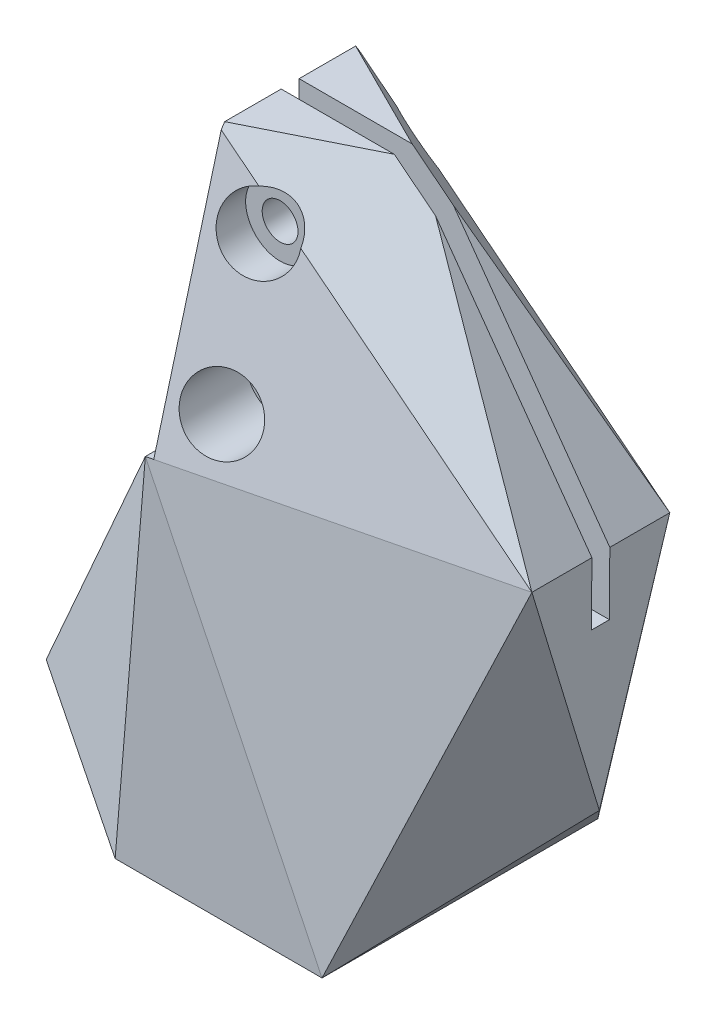
ISO-10303-21;
HEADER;
FILE_DESCRIPTION(('STEP AP214'),'2;1');
FILE_NAME('part.step','',(''),(''),'','','');
FILE_SCHEMA(('AUTOMOTIVE_DESIGN { 1 0 10303 214 1 1 1 1 }'));
ENDSEC;
DATA;
#1=APPLICATION_CONTEXT('core data for automotive mechanical design processes');
#2=APPLICATION_PROTOCOL_DEFINITION('international standard','automotive_design',2000,#1);
#3=PRODUCT_CONTEXT('',#1,'mechanical');
#4=PRODUCT('Part','Part','',(#3));
#5=PRODUCT_RELATED_PRODUCT_CATEGORY('part','',(#4));
#6=PRODUCT_DEFINITION_FORMATION('','',#4);
#7=PRODUCT_DEFINITION_CONTEXT('part definition',#1,'design');
#8=PRODUCT_DEFINITION('design','',#6,#7);
#9=PRODUCT_DEFINITION_SHAPE('','',#8);
#10=(LENGTH_UNIT() NAMED_UNIT(*) SI_UNIT(.MILLI.,.METRE.));
#11=(NAMED_UNIT(*) PLANE_ANGLE_UNIT() SI_UNIT($,.RADIAN.));
#12=(NAMED_UNIT(*) SI_UNIT($,.STERADIAN.) SOLID_ANGLE_UNIT());
#13=UNCERTAINTY_MEASURE_WITH_UNIT(LENGTH_MEASURE(1.E-05),#10,'distance_accuracy_value','');
#14=(GEOMETRIC_REPRESENTATION_CONTEXT(3) GLOBAL_UNCERTAINTY_ASSIGNED_CONTEXT((#13)) GLOBAL_UNIT_ASSIGNED_CONTEXT((#10,
#11,#12)) REPRESENTATION_CONTEXT('',''));
#15=CARTESIAN_POINT('',(0.,0.,0.));
#16=DIRECTION('',(0.,0.,1.));
#17=DIRECTION('',(1.,0.,0.));
#18=AXIS2_PLACEMENT_3D('',#15,#16,#17);
#19=CARTESIAN_POINT('',(-9.58235878698284,-34.6808000577524,25.4));
#20=DIRECTION('',(0.837497848640576,-0.546440622137856,0.));
#21=DIRECTION('',(0.546440622137856,0.837497848640576,0.));
#22=AXIS2_PLACEMENT_3D('',#19,#20,#21);
#23=PLANE('',#22);
#24=DIRECTION('',(-0.546440622137856,-0.837497848640576,0.));
#25=VECTOR('',#24,1.);
#26=CARTESIAN_POINT('',(-9.58235878698284,-34.6808000577524,11.049));
#27=LINE('',#26,#25);
#28=CARTESIAN_POINT('',(-9.58235878698284,-34.6808000577524,11.049));
#29=VERTEX_POINT('',#28);
#30=CARTESIAN_POINT('',(-16.3338265826701,-45.0283831710512,11.049));
#31=VERTEX_POINT('',#30);
#32=EDGE_CURVE('E296',#29,#31,#27,.T.);
#33=ORIENTED_EDGE('',*,*,#32,.F.);
#34=DIRECTION('',(0.,0.,-1.));
#35=VECTOR('',#34,1.);
#36=CARTESIAN_POINT('',(-9.58235878698284,-34.6808000577524,25.4));
#37=LINE('',#36,#35);
#38=CARTESIAN_POINT('',(-9.58235878698284,-34.6808000577524,-12.7));
#39=VERTEX_POINT('',#38);
#40=EDGE_CURVE('E197',#29,#39,#37,.T.);
#41=ORIENTED_EDGE('',*,*,#40,.T.);
#42=DIRECTION('',(0.520762367262036,0.798142276700834,-0.302944653338607));
#43=VECTOR('',#42,1.);
#44=CARTESIAN_POINT('',(-15.5930976477007,-43.8931108938262,-9.20335486021627));
#45=LINE('',#44,#43);
#46=CARTESIAN_POINT('',(-53.2450013940838,-101.6,12.7));
#47=VERTEX_POINT('',#46);
#48=EDGE_CURVE('E227',#47,#39,#45,.T.);
#49=ORIENTED_EDGE('',*,*,#48,.F.);
#50=DIRECTION('',(-0.520762367262036,-0.798142276700834,-0.302944653338607));
#51=VECTOR('',#50,1.);
#52=CARTESIAN_POINT('',(-11.5859384072221,-37.7515703364437,36.9344516200721));
#53=LINE('',#52,#51);
#54=CARTESIAN_POINT('',(-9.58235878698284,-34.6808000577524,38.1));
#55=VERTEX_POINT('',#54);
#56=EDGE_CURVE('E216',#55,#47,#53,.T.);
#57=ORIENTED_EDGE('',*,*,#56,.F.);
#58=CARTESIAN_POINT('',(-9.58235878698284,-34.6808000577524,14.351));
#59=VERTEX_POINT('',#58);
#60=EDGE_CURVE('E187',#55,#59,#37,.T.);
#61=ORIENTED_EDGE('',*,*,#60,.T.);
#62=DIRECTION('',(-0.546440622137856,-0.837497848640576,0.));
#63=VECTOR('',#62,1.);
#64=CARTESIAN_POINT('',(-9.58235878698284,-34.6808000577524,14.351));
#65=LINE('',#64,#63);
#66=CARTESIAN_POINT('',(-16.3338265826701,-45.0283831710512,14.351));
#67=VERTEX_POINT('',#66);
#68=EDGE_CURVE('E270',#59,#67,#65,.T.);
#69=ORIENTED_EDGE('',*,*,#68,.T.);
#70=DIRECTION('',(0.,0.,-1.));
#71=VECTOR('',#70,1.);
#72=CARTESIAN_POINT('',(-16.3338265826701,-45.0283831710512,25.4));
#73=LINE('',#72,#71);
#74=EDGE_CURVE('E298',#67,#31,#73,.T.);
#75=ORIENTED_EDGE('',*,*,#74,.T.);
#76=EDGE_LOOP('',(#33,#41,#49,#57,#61,#69,#75));
#77=FACE_BOUND('',#76,.T.);
#78=ADVANCED_FACE('F63',(#77),#23,.F.);
#79=CARTESIAN_POINT('',(48.9151984851401,-33.4491422234161,25.4));
#80=DIRECTION('',(-0.99997769081638,0.00667966088518276,0.));
#81=DIRECTION('',(-0.00667966088518276,-0.99997769081638,0.));
#82=AXIS2_PLACEMENT_3D('',#79,#80,#81);
#83=PLANE('',#82);
#84=DIRECTION('',(0.00667966088518276,0.99997769081638,0.));
#85=VECTOR('',#84,1.);
#86=CARTESIAN_POINT('',(48.9151984851401,-33.4491422234161,11.049));
#87=LINE('',#86,#85);
#88=CARTESIAN_POINT('',(48.8378513567508,-45.0283831710512,11.049));
#89=VERTEX_POINT('',#88);
#90=CARTESIAN_POINT('',(48.9151984851401,-33.4491422234161,11.049));
#91=VERTEX_POINT('',#90);
#92=EDGE_CURVE('E294',#89,#91,#87,.T.);
#93=ORIENTED_EDGE('',*,*,#92,.F.);
#94=DIRECTION('',(0.,0.,1.));
#95=VECTOR('',#94,1.);
#96=CARTESIAN_POINT('',(48.8378513567508,-45.0283831710512,25.4));
#97=LINE('',#96,#95);
#98=CARTESIAN_POINT('',(48.8378513567508,-45.0283831710512,14.351));
#99=VERTEX_POINT('',#98);
#100=EDGE_CURVE('E260',#89,#99,#97,.T.);
#101=ORIENTED_EDGE('',*,*,#100,.T.);
#102=DIRECTION('',(0.00667966088518276,0.99997769081638,0.));
#103=VECTOR('',#102,1.);
#104=CARTESIAN_POINT('',(48.9151984851401,-33.4491422234161,14.351));
#105=LINE('',#104,#103);
#106=CARTESIAN_POINT('',(48.9151984851401,-33.4491422234161,14.351));
#107=VERTEX_POINT('',#106);
#108=EDGE_CURVE('E279',#99,#107,#105,.T.);
#109=ORIENTED_EDGE('',*,*,#108,.T.);
#110=DIRECTION('',(0.,0.,-1.));
#111=VECTOR('',#110,1.);
#112=CARTESIAN_POINT('',(48.9151984851401,-33.4491422234161,25.4));
#113=LINE('',#112,#111);
#114=CARTESIAN_POINT('',(48.9151984851401,-33.4491422234161,25.4));
#115=VERTEX_POINT('',#114);
#116=EDGE_CURVE('E367',#115,#107,#113,.T.);
#117=ORIENTED_EDGE('',*,*,#116,.F.);
#118=DIRECTION('',(0.00638433306019924,0.955765680425864,0.294059865353064));
#119=VECTOR('',#118,1.);
#120=CARTESIAN_POINT('',(48.9151984851401,-33.4491422234161,25.4));
#121=LINE('',#120,#119);
#122=CARTESIAN_POINT('',(48.639468814356,-74.7272137032992,12.7));
#123=VERTEX_POINT('',#122);
#124=EDGE_CURVE('E233',#123,#115,#121,.T.);
#125=ORIENTED_EDGE('',*,*,#124,.F.);
#126=DIRECTION('',(-0.00638433306019924,-0.955765680425864,0.294059865353064));
#127=VECTOR('',#126,1.);
#128=CARTESIAN_POINT('',(48.8675131316908,-40.5878713367119,2.19636859205113));
#129=LINE('',#128,#127);
#130=CARTESIAN_POINT('',(48.9151984851401,-33.4491422234161,0.));
#131=VERTEX_POINT('',#130);
#132=EDGE_CURVE('E342',#131,#123,#129,.T.);
#133=ORIENTED_EDGE('',*,*,#132,.F.);
#134=EDGE_CURVE('E366',#91,#131,#113,.T.);
#135=ORIENTED_EDGE('',*,*,#134,.F.);
#136=EDGE_LOOP('',(#93,#101,#109,#117,#125,#133,#135));
#137=FACE_BOUND('',#136,.T.);
#138=ADVANCED_FACE('F397',(#137),#83,.F.);
#139=CARTESIAN_POINT('',(-9.58235878698284,12.7,25.4));
#140=DIRECTION('',(0.,-1.,0.));
#141=DIRECTION('',(0.,0.,-1.));
#142=AXIS2_PLACEMENT_3D('',#139,#140,#141);
#143=PLANE('',#142);
#144=DIRECTION('',(0.894427190999916,0.,0.447213595499958));
#145=VECTOR('',#144,1.);
#146=CARTESIAN_POINT('',(0.57764121301716,12.7,5.07999999999999));
#147=LINE('',#146,#145);
#148=CARTESIAN_POINT('',(-8.31235878698285,12.7,0.63499999999998));
#149=VERTEX_POINT('',#148);
#150=CARTESIAN_POINT('',(12.5156412130172,12.7,11.049));
#151=VERTEX_POINT('',#150);
#152=EDGE_CURVE('E351',#149,#151,#147,.T.);
#153=ORIENTED_EDGE('',*,*,#152,.F.);
#154=DIRECTION('',(0.,0.,1.));
#155=VECTOR('',#154,1.);
#156=CARTESIAN_POINT('',(-8.31235878698284,12.7,-12.7));
#157=LINE('',#156,#155);
#158=CARTESIAN_POINT('',(-8.31235878698284,12.7,11.049));
#159=VERTEX_POINT('',#158);
#160=EDGE_CURVE('E826',#149,#159,#157,.T.);
#161=ORIENTED_EDGE('',*,*,#160,.T.);
#162=DIRECTION('',(-1.,0.,0.));
#163=VECTOR('',#162,1.);
#164=CARTESIAN_POINT('',(-9.58235878698284,12.7,11.049));
#165=LINE('',#164,#163);
#166=EDGE_CURVE('E291',#151,#159,#165,.T.);
#167=ORIENTED_EDGE('',*,*,#166,.F.);
#168=EDGE_LOOP('',(#153,#161,#167));
#169=FACE_BOUND('',#168,.T.);
#170=ADVANCED_FACE('F441',(#169),#143,.F.);
#171=CARTESIAN_POINT('',(15.8176412130172,12.7,25.4));
#172=DIRECTION('',(-0.812616939968756,-0.582798171647626,0.));
#173=DIRECTION('',(0.582798171647626,-0.812616939968756,0.));
#174=AXIS2_PLACEMENT_3D('',#171,#172,#173);
#175=PLANE('',#174);
#176=DIRECTION('',(-0.582798171647626,0.812616939968756,0.));
#177=VECTOR('',#176,1.);
#178=CARTESIAN_POINT('',(15.8176412130172,12.7,11.049));
#179=LINE('',#178,#177);
#180=CARTESIAN_POINT('',(20.1203236583931,6.70061151095598,11.049));
#181=VERTEX_POINT('',#180);
#182=EDGE_CURVE('E86',#91,#181,#179,.T.);
#183=ORIENTED_EDGE('',*,*,#182,.F.);
#184=ORIENTED_EDGE('',*,*,#134,.T.);
#185=DIRECTION('',(0.568750223836933,-0.793029369317163,-0.218237490559851));
#186=VECTOR('',#185,1.);
#187=CARTESIAN_POINT('',(14.241283918627,14.8979729916505,13.3048705490304));
#188=LINE('',#187,#186);
#189=EDGE_CURVE('E348',#181,#131,#188,.T.);
#190=ORIENTED_EDGE('',*,*,#189,.F.);
#191=EDGE_LOOP('',(#183,#184,#190));
#192=FACE_BOUND('',#191,.T.);
#193=ADVANCED_FACE('F456',(#192),#175,.F.);
#194=CARTESIAN_POINT('',(8.67534920626133,10.9966667330913,8.04930158747733));
#195=DIRECTION('',(0.389050588844536,0.493151291794514,-0.778101177689072));
#196=DIRECTION('',(0.,-0.844645389688986,-0.535326223603085));
#197=AXIS2_PLACEMENT_3D('',#194,#195,#196);
#198=PLANE('',#197);
#199=DIRECTION('',(0.,-0.844645389688986,-0.535326223603085));
#200=VECTOR('',#199,1.);
#201=CARTESIAN_POINT('',(-8.31235878698285,14.8372547784634,1.98956671332066));
#202=LINE('',#201,#200);
#203=CARTESIAN_POINT('',(-8.31235878698284,11.6980878970537,0.));
#204=VERTEX_POINT('',#203);
#205=EDGE_CURVE('E836',#149,#204,#202,.T.);
#206=ORIENTED_EDGE('',*,*,#205,.F.);
#207=ORIENTED_EDGE('',*,*,#152,.T.);
#208=DIRECTION('',(0.785099031532993,-0.619370253310535,0.));
#209=VECTOR('',#208,1.);
#210=CARTESIAN_POINT('',(10.9768348806961,13.9139753452307,11.049));
#211=LINE('',#210,#209);
#212=EDGE_CURVE('E288',#151,#181,#211,.T.);
#213=ORIENTED_EDGE('',*,*,#212,.T.);
#214=ORIENTED_EDGE('',*,*,#189,.T.);
#215=DIRECTION('',(0.785099031532993,-0.619370253310535,0.));
#216=VECTOR('',#215,1.);
#217=CARTESIAN_POINT('',(2.49961093355784,3.16844748784153,0.));
#218=LINE('',#217,#216);
#219=CARTESIAN_POINT('',(6.34862935351327,0.131929267828256,0.));
#220=VERTEX_POINT('',#219);
#221=EDGE_CURVE('E345',#220,#131,#218,.T.);
#222=ORIENTED_EDGE('',*,*,#221,.F.);
#223=CARTESIAN_POINT('',(0.,0.,-3.25792988094928));
#224=DIRECTION('',(0.389050588844536,0.493151291794514,-0.778101177689072));
#225=DIRECTION('',(-0.481932723526507,-0.610886481038372,-0.628138963350371));
#226=AXIS2_PLACEMENT_3D('',#223,#224,#225);
#227=ELLIPSE('',#226,8.16089241614983,6.35);
#228=CARTESIAN_POINT('',(-1.34940748639759,6.20496570785481,0.));
#229=VERTEX_POINT('',#228);
#230=EDGE_CURVE('E221',#220,#229,#227,.F.);
#231=ORIENTED_EDGE('',*,*,#230,.T.);
#232=EDGE_CURVE('E346',#204,#229,#218,.T.);
#233=ORIENTED_EDGE('',*,*,#232,.F.);
#234=EDGE_LOOP('',(#206,#207,#213,#214,#222,#231,#233));
#235=FACE_BOUND('',#234,.T.);
#236=ADVANCED_FACE('F469',(#235),#198,.T.);
#237=CARTESIAN_POINT('',(0.,-25.4,-12.7));
#238=DIRECTION('',(0.,0.,1.));
#239=DIRECTION('',(1.,0.,0.));
#240=AXIS2_PLACEMENT_3D('',#237,#238,#239);
#241=CYLINDRICAL_SURFACE('',#240,3.302);
#242=CARTESIAN_POINT('',(0.,-25.4,2.54));
#243=DIRECTION('',(0.,0.,1.));
#244=DIRECTION('',(1.,0.,0.));
#245=AXIS2_PLACEMENT_3D('',#242,#243,#244);
#246=CIRCLE('',#245,3.302);
#247=CARTESIAN_POINT('',(3.302,-25.4,2.54));
#248=VERTEX_POINT('',#247);
#249=EDGE_CURVE('E313',#248,#248,#246,.T.);
#250=ORIENTED_EDGE('',*,*,#249,.F.);
#251=EDGE_LOOP('',(#250));
#252=FACE_BOUND('',#251,.T.);
#253=CARTESIAN_POINT('',(0.,-25.4,11.049));
#254=DIRECTION('',(0.,0.,1.));
#255=DIRECTION('',(1.,0.,0.));
#256=AXIS2_PLACEMENT_3D('',#253,#254,#255);
#257=CIRCLE('',#256,3.302);
#258=CARTESIAN_POINT('',(3.302,-25.4,11.049));
#259=VERTEX_POINT('',#258);
#260=EDGE_CURVE('E269',#259,#259,#257,.F.);
#261=ORIENTED_EDGE('',*,*,#260,.F.);
#262=EDGE_LOOP('',(#261));
#263=FACE_BOUND('',#262,.T.);
#264=ADVANCED_FACE('F472',(#252,#263),#241,.F.);
#265=CARTESIAN_POINT('',(0.,0.,-12.7));
#266=DIRECTION('',(0.,0.,1.));
#267=DIRECTION('',(1.,0.,0.));
#268=AXIS2_PLACEMENT_3D('',#265,#266,#267);
#269=CYLINDRICAL_SURFACE('',#268,3.302);
#270=CARTESIAN_POINT('',(0.,0.,2.54));
#271=DIRECTION('',(0.,0.,1.));
#272=DIRECTION('',(1.,0.,0.));
#273=AXIS2_PLACEMENT_3D('',#270,#271,#272);
#274=CIRCLE('',#273,3.302);
#275=CARTESIAN_POINT('',(3.302,0.,2.54));
#276=VERTEX_POINT('',#275);
#277=EDGE_CURVE('E314',#276,#276,#274,.T.);
#278=ORIENTED_EDGE('',*,*,#277,.F.);
#279=EDGE_LOOP('',(#278));
#280=FACE_BOUND('',#279,.T.);
#281=CARTESIAN_POINT('',(0.,0.,11.049));
#282=DIRECTION('',(0.,0.,1.));
#283=DIRECTION('',(1.,0.,0.));
#284=AXIS2_PLACEMENT_3D('',#281,#282,#283);
#285=CIRCLE('',#284,3.302);
#286=CARTESIAN_POINT('',(3.302,0.,11.049));
#287=VERTEX_POINT('',#286);
#288=EDGE_CURVE('E266',#287,#287,#285,.F.);
#289=ORIENTED_EDGE('',*,*,#288,.F.);
#290=EDGE_LOOP('',(#289));
#291=FACE_BOUND('',#290,.T.);
#292=ADVANCED_FACE('F447',(#280,#291),#269,.F.);
#293=CARTESIAN_POINT('',(22.9549986059162,-101.6,25.4));
#294=DIRECTION('',(0.,1.,0.));
#295=DIRECTION('',(-1.,0.,0.));
#296=AXIS2_PLACEMENT_3D('',#293,#294,#295);
#297=PLANE('',#296);
#298=DIRECTION('',(0.832050294337844,0.,0.554700196225229));
#299=VECTOR('',#298,1.);
#300=CARTESIAN_POINT('',(5.37038322130083,-101.6,51.7769230769231));
#301=LINE('',#300,#299);
#302=CARTESIAN_POINT('',(-15.1450013940838,-101.6,38.1));
#303=VERTEX_POINT('',#302);
#304=EDGE_CURVE('E218',#47,#303,#301,.T.);
#305=ORIENTED_EDGE('',*,*,#304,.F.);
#306=DIRECTION('',(-0.832050294337844,0.,0.554700196225229));
#307=VECTOR('',#306,1.);
#308=CARTESIAN_POINT('',(-6.35269370177609,-101.6,-18.5615384615385));
#309=LINE('',#308,#307);
#310=CARTESIAN_POINT('',(-15.1450013940838,-101.6,-12.7));
#311=VERTEX_POINT('',#310);
#312=EDGE_CURVE('E236',#311,#47,#309,.T.);
#313=ORIENTED_EDGE('',*,*,#312,.F.);
#314=DIRECTION('',(1.,0.,0.));
#315=VECTOR('',#314,1.);
#316=CARTESIAN_POINT('',(-53.2450013940838,-101.6,-12.7));
#317=LINE('',#316,#315);
#318=CARTESIAN_POINT('',(22.9549986059162,-101.6,-12.7));
#319=VERTEX_POINT('',#318);
#320=EDGE_CURVE('E340',#311,#319,#317,.T.);
#321=ORIENTED_EDGE('',*,*,#320,.T.);
#322=DIRECTION('',(0.,0.,-1.));
#323=VECTOR('',#322,1.);
#324=CARTESIAN_POINT('',(22.9549986059162,-101.6,25.4));
#325=LINE('',#324,#323);
#326=CARTESIAN_POINT('',(22.9549986059162,-101.6,38.1));
#327=VERTEX_POINT('',#326);
#328=EDGE_CURVE('E370',#327,#319,#325,.T.);
#329=ORIENTED_EDGE('',*,*,#328,.F.);
#330=DIRECTION('',(1.,0.,0.));
#331=VECTOR('',#330,1.);
#332=CARTESIAN_POINT('',(-53.2450013940838,-101.6,38.1));
#333=LINE('',#332,#331);
#334=EDGE_CURVE('E230',#303,#327,#333,.T.);
#335=ORIENTED_EDGE('',*,*,#334,.F.);
#336=EDGE_LOOP('',(#305,#313,#321,#329,#335));
#337=FACE_BOUND('',#336,.T.);
#338=ADVANCED_FACE('F444',(#337),#297,.F.);
#339=CARTESIAN_POINT('',(0.,0.,38.1));
#340=DIRECTION('',(0.,0.,1.));
#341=DIRECTION('',(1.,0.,0.));
#342=AXIS2_PLACEMENT_3D('',#339,#340,#341);
#343=PLANE('',#342);
#344=DIRECTION('',(-0.437270871141113,0.899329853419474,0.));
#345=VECTOR('',#344,1.);
#346=CARTESIAN_POINT('',(-21.3884066473898,-10.3994403960503,38.1));
#347=LINE('',#346,#345);
#348=EDGE_CURVE('E206',#327,#55,#347,.T.);
#349=ORIENTED_EDGE('',*,*,#348,.T.);
#350=DIRECTION('',(-0.0828390576623097,-0.996562938567164,0.));
#351=VECTOR('',#350,1.);
#352=CARTESIAN_POINT('',(-6.65355129874775,0.55307487200815,38.1));
#353=LINE('',#352,#351);
#354=EDGE_CURVE('E214',#55,#303,#353,.T.);
#355=ORIENTED_EDGE('',*,*,#354,.T.);
#356=ORIENTED_EDGE('',*,*,#334,.T.);
#357=EDGE_LOOP('',(#349,#355,#356));
#358=FACE_BOUND('',#357,.T.);
#359=ADVANCED_FACE('F229',(#358),#343,.T.);
#360=CARTESIAN_POINT('',(0.,0.,-12.7));
#361=DIRECTION('',(0.,0.,-1.));
#362=DIRECTION('',(1.,0.,0.));
#363=AXIS2_PLACEMENT_3D('',#360,#361,#362);
#364=PLANE('',#363);
#365=ORIENTED_EDGE('',*,*,#320,.F.);
#366=DIRECTION('',(0.0828390576623097,0.996562938567164,0.));
#367=VECTOR('',#366,1.);
#368=CARTESIAN_POINT('',(-6.65355129874776,0.553074872008151,-12.7));
#369=LINE('',#368,#367);
#370=EDGE_CURVE('E328',#311,#39,#369,.T.);
#371=ORIENTED_EDGE('',*,*,#370,.T.);
#372=DIRECTION('',(0.437270871141113,-0.899329853419474,0.));
#373=VECTOR('',#372,1.);
#374=CARTESIAN_POINT('',(-21.3884066473898,-10.3994403960503,-12.7));
#375=LINE('',#374,#373);
#376=EDGE_CURVE('E232',#39,#319,#375,.T.);
#377=ORIENTED_EDGE('',*,*,#376,.T.);
#378=EDGE_LOOP('',(#365,#371,#377));
#379=FACE_BOUND('',#378,.T.);
#380=ADVANCED_FACE('F451',(#379),#364,.T.);
#381=CARTESIAN_POINT('',(48.6394688143563,-74.7272137032988,25.4));
#382=DIRECTION('',(-0.72290966327967,0.690942558203555,0.));
#383=DIRECTION('',(-0.690942558203555,-0.72290966327967,0.));
#384=AXIS2_PLACEMENT_3D('',#381,#382,#383);
#385=PLANE('',#384);
#386=ORIENTED_EDGE('',*,*,#328,.T.);
#387=DIRECTION('',(-0.570484543008427,-0.59687854510617,-0.564166100169452));
#388=VECTOR('',#387,1.);
#389=CARTESIAN_POINT('',(22.9549986059162,-101.6,-12.7));
#390=LINE('',#389,#388);
#391=EDGE_CURVE('E331',#123,#319,#390,.T.);
#392=ORIENTED_EDGE('',*,*,#391,.F.);
#393=DIRECTION('',(0.570484543008424,0.596878545106177,-0.564166100169448));
#394=VECTOR('',#393,1.);
#395=CARTESIAN_POINT('',(48.6394688143563,-74.7272137032988,12.7));
#396=LINE('',#395,#394);
#397=EDGE_CURVE('E353',#327,#123,#396,.T.);
#398=ORIENTED_EDGE('',*,*,#397,.F.);
#399=EDGE_LOOP('',(#386,#392,#398));
#400=FACE_BOUND('',#399,.T.);
#401=ADVANCED_FACE('F449',(#400),#385,.F.);
#402=DIRECTION('',(-1.,0.,0.));
#403=VECTOR('',#402,1.);
#404=CARTESIAN_POINT('',(-9.58235878698284,12.7,14.351));
#405=LINE('',#404,#403);
#406=CARTESIAN_POINT('',(12.5156412130172,12.7,14.351));
#407=VERTEX_POINT('',#406);
#408=CARTESIAN_POINT('',(-8.31235878698284,12.7,14.351));
#409=VERTEX_POINT('',#408);
#410=EDGE_CURVE('E282',#407,#409,#405,.T.);
#411=ORIENTED_EDGE('',*,*,#410,.T.);
#412=CARTESIAN_POINT('',(-8.31235878698285,12.7,24.765));
#413=VERTEX_POINT('',#412);
#414=EDGE_CURVE('E414',#409,#413,#157,.T.);
#415=ORIENTED_EDGE('',*,*,#414,.T.);
#416=DIRECTION('',(-0.894427190999916,0.,0.447213595499958));
#417=VECTOR('',#416,1.);
#418=CARTESIAN_POINT('',(-9.58235878698284,12.7,25.4));
#419=LINE('',#418,#417);
#420=EDGE_CURVE('E363',#407,#413,#419,.T.);
#421=ORIENTED_EDGE('',*,*,#420,.F.);
#422=EDGE_LOOP('',(#411,#415,#421));
#423=FACE_BOUND('',#422,.T.);
#424=ADVANCED_FACE('F65',(#423),#143,.F.);
#425=ORIENTED_EDGE('',*,*,#116,.T.);
#426=DIRECTION('',(-0.582798171647626,0.812616939968756,0.));
#427=VECTOR('',#426,1.);
#428=CARTESIAN_POINT('',(15.8176412130172,12.7,14.351));
#429=LINE('',#428,#427);
#430=CARTESIAN_POINT('',(20.1203236583931,6.70061151095598,14.351));
#431=VERTEX_POINT('',#430);
#432=EDGE_CURVE('E395',#107,#431,#429,.T.);
#433=ORIENTED_EDGE('',*,*,#432,.T.);
#434=DIRECTION('',(-0.568750223836933,0.793029369317163,-0.218237490559851));
#435=VECTOR('',#434,1.);
#436=CARTESIAN_POINT('',(17.3939985074073,10.5020270083495,13.3048705490305));
#437=LINE('',#436,#435);
#438=EDGE_CURVE('E360',#115,#431,#437,.T.);
#439=ORIENTED_EDGE('',*,*,#438,.F.);
#440=EDGE_LOOP('',(#425,#433,#439));
#441=FACE_BOUND('',#440,.T.);
#442=ADVANCED_FACE('F394',(#441),#175,.F.);
#443=CARTESIAN_POINT('',(8.67534920626133,10.9966667330913,17.3506984125227));
#444=DIRECTION('',(0.389050588844536,0.493151291794514,0.778101177689072));
#445=DIRECTION('',(0.,-0.844645389688986,0.535326223603085));
#446=AXIS2_PLACEMENT_3D('',#443,#444,#445);
#447=PLANE('',#446);
#448=DIRECTION('',(0.,0.844645389688986,-0.535326223603085));
#449=VECTOR('',#448,1.);
#450=CARTESIAN_POINT('',(-8.31235878698285,14.8372547784634,23.4104332866793));
#451=LINE('',#450,#449);
#452=CARTESIAN_POINT('',(-8.31235878698284,11.6980878970536,25.4));
#453=VERTEX_POINT('',#452);
#454=EDGE_CURVE('E402',#453,#413,#451,.T.);
#455=ORIENTED_EDGE('',*,*,#454,.F.);
#456=DIRECTION('',(0.785099031532993,-0.619370253310535,0.));
#457=VECTOR('',#456,1.);
#458=CARTESIAN_POINT('',(2.49961093355784,3.16844748784153,25.4));
#459=LINE('',#458,#457);
#460=CARTESIAN_POINT('',(-1.34940748639759,6.20496570785481,25.4));
#461=VERTEX_POINT('',#460);
#462=EDGE_CURVE('E239',#453,#461,#459,.T.);
#463=ORIENTED_EDGE('',*,*,#462,.T.);
#464=CARTESIAN_POINT('',(0.,0.,28.6579298809493));
#465=DIRECTION('',(0.389050588844536,0.493151291794514,0.778101177689072));
#466=DIRECTION('',(-0.481932723526507,-0.610886481038372,0.628138963350371));
#467=AXIS2_PLACEMENT_3D('',#464,#465,#466);
#468=ELLIPSE('',#467,8.16089241614983,6.35);
#469=CARTESIAN_POINT('',(6.34862935351327,0.131929267828255,25.4));
#470=VERTEX_POINT('',#469);
#471=EDGE_CURVE('E256',#470,#461,#468,.T.);
#472=ORIENTED_EDGE('',*,*,#471,.F.);
#473=EDGE_CURVE('E196',#470,#115,#459,.T.);
#474=ORIENTED_EDGE('',*,*,#473,.T.);
#475=ORIENTED_EDGE('',*,*,#438,.T.);
#476=DIRECTION('',(0.785099031532993,-0.619370253310535,0.));
#477=VECTOR('',#476,1.);
#478=CARTESIAN_POINT('',(10.9768348806961,13.9139753452307,14.351));
#479=LINE('',#478,#477);
#480=EDGE_CURVE('E409',#407,#431,#479,.T.);
#481=ORIENTED_EDGE('',*,*,#480,.F.);
#482=ORIENTED_EDGE('',*,*,#420,.T.);
#483=EDGE_LOOP('',(#455,#463,#472,#474,#475,#481,#482));
#484=FACE_BOUND('',#483,.T.);
#485=ADVANCED_FACE('F377',(#484),#447,.T.);
#486=CARTESIAN_POINT('',(6.59018817220823,3.20427183873462,30.665864295381));
#487=DIRECTION('',(0.209018280236997,0.101628568356908,0.972616570196341));
#488=DIRECTION('',(0.977678585794956,0.,-0.210106122895015));
#489=AXIS2_PLACEMENT_3D('',#486,#487,#488);
#490=PLANE('',#489);
#491=DIRECTION('',(0.350693089287293,0.920641403473032,-0.171562709635106));
#492=VECTOR('',#491,1.);
#493=CARTESIAN_POINT('',(48.151092105705,-35.4550784424488,25.7738087943842));
#494=LINE('',#493,#492);
#495=EDGE_CURVE('E357',#327,#115,#494,.T.);
#496=ORIENTED_EDGE('',*,*,#495,.T.);
#497=DIRECTION('',(-0.977028002405346,-0.0205711870656511,0.212115790969293));
#498=VECTOR('',#497,1.);
#499=CARTESIAN_POINT('',(-9.58235878698284,-34.6808000577524,38.1));
#500=LINE('',#499,#498);
#501=CARTESIAN_POINT('',(-8.31235878698284,-34.6540603865157,37.8242790852792));
#502=VERTEX_POINT('',#501);
#503=EDGE_CURVE('E208',#115,#502,#500,.T.);
#504=ORIENTED_EDGE('',*,*,#503,.T.);
#505=DIRECTION('',(-0.977028002405346,-0.0205711870656468,0.212115790969292));
#506=VECTOR('',#505,1.);
#507=CARTESIAN_POINT('',(8.15780218203944,-34.3072834656281,34.2485563703367));
#508=LINE('',#507,#506);
#509=EDGE_CURVE('E190',#502,#55,#508,.T.);
#510=ORIENTED_EDGE('',*,*,#509,.T.);
#511=ORIENTED_EDGE('',*,*,#348,.F.);
#512=EDGE_LOOP('',(#496,#504,#510,#511));
#513=FACE_BOUND('',#512,.T.);
#514=ADVANCED_FACE('F204',(#513),#490,.T.);
#515=CARTESIAN_POINT('',(46.6951372941815,-11.1953058546964,35.3736535807857));
#516=DIRECTION('',(-0.782934966781222,0.187711117802936,-0.593108231307288));
#517=DIRECTION('',(-0.603841956846717,0.,0.797104065446619));
#518=AXIS2_PLACEMENT_3D('',#515,#516,#517);
#519=PLANE('',#518);
#520=ORIENTED_EDGE('',*,*,#397,.T.);
#521=ORIENTED_EDGE('',*,*,#124,.T.);
#522=ORIENTED_EDGE('',*,*,#495,.F.);
#523=EDGE_LOOP('',(#520,#521,#522));
#524=FACE_BOUND('',#523,.T.);
#525=ADVANCED_FACE('F387',(#524),#519,.F.);
#526=CARTESIAN_POINT('',(5.07131136724856,6.42827391491289,23.982422132201));
#527=DIRECTION('',(-0.200117919415534,-0.253664724590448,-0.946365165159438));
#528=DIRECTION('',(0.,0.965903638279229,-0.258901837689402));
#529=AXIS2_PLACEMENT_3D('',#526,#527,#528);
#530=PLANE('',#529);
#531=CARTESIAN_POINT('',(0.,-25.4,33.5860835421248));
#532=DIRECTION('',(-0.200117919415534,-0.253664724590448,-0.946365165159438));
#533=DIRECTION('',(-0.586150432069067,-0.742990374643236,0.323099016050421));
#534=AXIS2_PLACEMENT_3D('',#531,#532,#533);
#535=ELLIPSE('',#534,6.70988349294344,6.35);
#536=CARTESIAN_POINT('',(-3.9330011085219,-30.3853788502345,35.7540402965078));
#537=VERTEX_POINT('',#536);
#538=EDGE_CURVE('E253',#537,#537,#535,.T.);
#539=ORIENTED_EDGE('',*,*,#538,.T.);
#540=EDGE_LOOP('',(#539));
#541=FACE_BOUND('',#540,.T.);
#542=ORIENTED_EDGE('',*,*,#462,.F.);
#543=DIRECTION('',(0.,-0.965903638279229,0.258901837689402));
#544=VECTOR('',#543,1.);
#545=CARTESIAN_POINT('',(-8.31235878698284,7.13601008699712,26.6228241844185));
#546=LINE('',#545,#544);
#547=EDGE_CURVE('E383',#453,#502,#546,.T.);
#548=ORIENTED_EDGE('',*,*,#547,.T.);
#549=ORIENTED_EDGE('',*,*,#503,.F.);
#550=ORIENTED_EDGE('',*,*,#473,.F.);
#551=CARTESIAN_POINT('',(0.,0.,26.7778405490389));
#552=DIRECTION('',(-0.200117919415534,-0.253664724590448,-0.946365165159438));
#553=DIRECTION('',(-0.586150432069067,-0.742990374643236,0.323099016050421));
#554=AXIS2_PLACEMENT_3D('',#551,#552,#553);
#555=ELLIPSE('',#554,6.70988349294344,6.35);
#556=EDGE_CURVE('E252',#470,#461,#555,.T.);
#557=ORIENTED_EDGE('',*,*,#556,.T.);
#558=EDGE_LOOP('',(#542,#548,#549,#550,#557));
#559=FACE_BOUND('',#558,.T.);
#560=ADVANCED_FACE('F382',(#541,#559),#530,.F.);
#561=CARTESIAN_POINT('',(6.59018817220823,3.20427183873462,-5.26586429538101));
#562=DIRECTION('',(0.209018280236997,0.101628568356908,-0.972616570196341));
#563=DIRECTION('',(0.977678585794956,0.,0.210106122895015));
#564=AXIS2_PLACEMENT_3D('',#561,#562,#563);
#565=PLANE('',#564);
#566=DIRECTION('',(0.350693089287293,0.920641403473032,0.171562709635106));
#567=VECTOR('',#566,1.);
#568=CARTESIAN_POINT('',(48.151092105705,-35.4550784424488,-0.373808794384228));
#569=LINE('',#568,#567);
#570=EDGE_CURVE('E334',#319,#131,#569,.T.);
#571=ORIENTED_EDGE('',*,*,#570,.F.);
#572=ORIENTED_EDGE('',*,*,#376,.F.);
#573=DIRECTION('',(0.977028002405346,0.0205711870656468,0.212115790969292));
#574=VECTOR('',#573,1.);
#575=CARTESIAN_POINT('',(2.89382826679376,-34.4181156954645,-9.99138133331134));
#576=LINE('',#575,#574);
#577=CARTESIAN_POINT('',(-8.31235878698284,-34.6540603865157,-12.4242790852793));
#578=VERTEX_POINT('',#577);
#579=EDGE_CURVE('E210',#39,#578,#576,.T.);
#580=ORIENTED_EDGE('',*,*,#579,.T.);
#581=DIRECTION('',(-0.977028002405346,-0.0205711870656511,-0.212115790969293));
#582=VECTOR('',#581,1.);
#583=CARTESIAN_POINT('',(-9.58235878698284,-34.6808000577524,-12.7));
#584=LINE('',#583,#582);
#585=EDGE_CURVE('E337',#131,#578,#584,.T.);
#586=ORIENTED_EDGE('',*,*,#585,.F.);
#587=EDGE_LOOP('',(#571,#572,#580,#586));
#588=FACE_BOUND('',#587,.T.);
#589=ADVANCED_FACE('F467',(#588),#565,.T.);
#590=CARTESIAN_POINT('',(0.260941819628828,0.330763656765957,-1.23400367618889));
#591=DIRECTION('',(-0.200117919415534,-0.253664724590448,0.946365165159438));
#592=DIRECTION('',(0.,-0.965903638279229,-0.258901837689402));
#593=AXIS2_PLACEMENT_3D('',#590,#591,#592);
#594=PLANE('',#593);
#595=ORIENTED_EDGE('',*,*,#585,.T.);
#596=DIRECTION('',(0.,0.965903638279229,0.258901837689402));
#597=VECTOR('',#596,1.);
#598=CARTESIAN_POINT('',(-8.31235878698284,0.784124721670296,-2.92539028801583));
#599=LINE('',#598,#597);
#600=EDGE_CURVE('E817',#578,#204,#599,.T.);
#601=ORIENTED_EDGE('',*,*,#600,.T.);
#602=ORIENTED_EDGE('',*,*,#232,.T.);
#603=CARTESIAN_POINT('',(0.,0.,-1.37784054903887));
#604=DIRECTION('',(-0.200117919415534,-0.253664724590448,0.946365165159438));
#605=DIRECTION('',(-0.586150432069067,-0.742990374643236,-0.323099016050421));
#606=AXIS2_PLACEMENT_3D('',#603,#604,#605);
#607=ELLIPSE('',#606,6.70988349294344,6.35);
#608=EDGE_CURVE('E245',#220,#229,#607,.F.);
#609=ORIENTED_EDGE('',*,*,#608,.F.);
#610=ORIENTED_EDGE('',*,*,#221,.T.);
#611=EDGE_LOOP('',(#595,#601,#602,#609,#610));
#612=FACE_BOUND('',#611,.T.);
#613=CARTESIAN_POINT('',(0.,-25.4,-8.18608354212484));
#614=DIRECTION('',(-0.200117919415534,-0.253664724590448,0.946365165159438));
#615=DIRECTION('',(-0.586150432069067,-0.742990374643236,-0.323099016050421));
#616=AXIS2_PLACEMENT_3D('',#613,#614,#615);
#617=ELLIPSE('',#616,6.70988349294344,6.35);
#618=CARTESIAN_POINT('',(-3.9330011085219,-30.3853788502345,-10.3540402965078));
#619=VERTEX_POINT('',#618);
#620=EDGE_CURVE('E246',#619,#619,#617,.F.);
#621=ORIENTED_EDGE('',*,*,#620,.F.);
#622=EDGE_LOOP('',(#621));
#623=FACE_BOUND('',#622,.T.);
#624=ADVANCED_FACE('F479',(#612,#623),#594,.F.);
#625=CARTESIAN_POINT('',(34.900261890425,-8.36744742414541,-26.4385082800565));
#626=DIRECTION('',(0.782934966781222,-0.187711117802937,-0.593108231307287));
#627=DIRECTION('',(-0.603841956846717,0.,-0.797104065446619));
#628=AXIS2_PLACEMENT_3D('',#625,#626,#627);
#629=PLANE('',#628);
#630=ORIENTED_EDGE('',*,*,#132,.T.);
#631=ORIENTED_EDGE('',*,*,#391,.T.);
#632=ORIENTED_EDGE('',*,*,#570,.T.);
#633=EDGE_LOOP('',(#630,#631,#632));
#634=FACE_BOUND('',#633,.T.);
#635=ADVANCED_FACE('F483',(#634),#629,.T.);
#636=CARTESIAN_POINT('',(-7.90612196260689,0.657194511053459,-11.8591829439103));
#637=DIRECTION('',(-0.554111469206843,0.046060384319499,-0.831167203810265));
#638=DIRECTION('',(-0.832050294337844,0.,0.554700196225229));
#639=AXIS2_PLACEMENT_3D('',#636,#637,#638);
#640=PLANE('',#639);
#641=ORIENTED_EDGE('',*,*,#312,.T.);
#642=ORIENTED_EDGE('',*,*,#48,.T.);
#643=ORIENTED_EDGE('',*,*,#370,.F.);
#644=EDGE_LOOP('',(#641,#642,#643));
#645=FACE_BOUND('',#644,.T.);
#646=ADVANCED_FACE('F487',(#645),#640,.T.);
#647=CARTESIAN_POINT('',(-7.90612196260689,0.657194511053459,37.2591829439103));
#648=DIRECTION('',(-0.554111469206843,0.046060384319499,0.831167203810265));
#649=DIRECTION('',(-0.832050294337844,0.,-0.554700196225229));
#650=AXIS2_PLACEMENT_3D('',#647,#648,#649);
#651=PLANE('',#650);
#652=ORIENTED_EDGE('',*,*,#56,.T.);
#653=ORIENTED_EDGE('',*,*,#304,.T.);
#654=ORIENTED_EDGE('',*,*,#354,.F.);
#655=EDGE_LOOP('',(#652,#653,#654));
#656=FACE_BOUND('',#655,.T.);
#657=ADVANCED_FACE('F215',(#656),#651,.T.);
#658=CARTESIAN_POINT('',(0.,-25.4,14.351));
#659=DIRECTION('',(0.,0.,1.));
#660=DIRECTION('',(1.,0.,0.));
#661=AXIS2_PLACEMENT_3D('',#658,#659,#660);
#662=CIRCLE('',#661,3.302);
#663=CARTESIAN_POINT('',(3.302,-25.4,14.351));
#664=VERTEX_POINT('',#663);
#665=EDGE_CURVE('E264',#664,#664,#662,.F.);
#666=ORIENTED_EDGE('',*,*,#665,.T.);
#667=EDGE_LOOP('',(#666));
#668=FACE_BOUND('',#667,.T.);
#669=CARTESIAN_POINT('',(0.,-25.4,22.86));
#670=DIRECTION('',(0.,0.,1.));
#671=DIRECTION('',(1.,0.,0.));
#672=AXIS2_PLACEMENT_3D('',#669,#670,#671);
#673=CIRCLE('',#672,3.302);
#674=CARTESIAN_POINT('',(3.302,-25.4,22.86));
#675=VERTEX_POINT('',#674);
#676=EDGE_CURVE('E300',#675,#675,#673,.T.);
#677=ORIENTED_EDGE('',*,*,#676,.T.);
#678=EDGE_LOOP('',(#677));
#679=FACE_BOUND('',#678,.T.);
#680=ADVANCED_FACE('F494',(#668,#679),#241,.F.);
#681=CARTESIAN_POINT('',(0.,0.,14.351));
#682=DIRECTION('',(0.,0.,1.));
#683=DIRECTION('',(1.,0.,0.));
#684=AXIS2_PLACEMENT_3D('',#681,#682,#683);
#685=CIRCLE('',#684,3.302);
#686=CARTESIAN_POINT('',(3.302,0.,14.351));
#687=VERTEX_POINT('',#686);
#688=EDGE_CURVE('E261',#687,#687,#685,.F.);
#689=ORIENTED_EDGE('',*,*,#688,.T.);
#690=EDGE_LOOP('',(#689));
#691=FACE_BOUND('',#690,.T.);
#692=CARTESIAN_POINT('',(0.,0.,22.86));
#693=DIRECTION('',(0.,0.,1.));
#694=DIRECTION('',(1.,0.,0.));
#695=AXIS2_PLACEMENT_3D('',#692,#693,#694);
#696=CIRCLE('',#695,3.302);
#697=CARTESIAN_POINT('',(3.302,0.,22.86));
#698=VERTEX_POINT('',#697);
#699=EDGE_CURVE('E301',#698,#698,#696,.T.);
#700=ORIENTED_EDGE('',*,*,#699,.T.);
#701=EDGE_LOOP('',(#700));
#702=FACE_BOUND('',#701,.T.);
#703=ADVANCED_FACE('F497',(#691,#702),#269,.F.);
#704=CARTESIAN_POINT('',(0.,0.,2.54));
#705=DIRECTION('',(0.,0.,-1.));
#706=DIRECTION('',(-1.,0.,0.));
#707=AXIS2_PLACEMENT_3D('',#704,#705,#706);
#708=CYLINDRICAL_SURFACE('',#707,6.35);
#709=ORIENTED_EDGE('',*,*,#608,.T.);
#710=ORIENTED_EDGE('',*,*,#230,.F.);
#711=EDGE_LOOP('',(#709,#710));
#712=FACE_BOUND('',#711,.T.);
#713=CARTESIAN_POINT('',(0.,0.,2.54));
#714=DIRECTION('',(0.,0.,1.));
#715=DIRECTION('',(1.,0.,0.));
#716=AXIS2_PLACEMENT_3D('',#713,#714,#715);
#717=CIRCLE('',#716,6.35);
#718=CARTESIAN_POINT('',(6.35,0.,2.54));
#719=VERTEX_POINT('',#718);
#720=EDGE_CURVE('E249',#719,#719,#717,.T.);
#721=ORIENTED_EDGE('',*,*,#720,.T.);
#722=EDGE_LOOP('',(#721));
#723=FACE_BOUND('',#722,.T.);
#724=ADVANCED_FACE('F501',(#712,#723),#708,.F.);
#725=CARTESIAN_POINT('',(0.,0.,2.54));
#726=DIRECTION('',(0.,0.,1.));
#727=DIRECTION('',(1.,0.,0.));
#728=AXIS2_PLACEMENT_3D('',#725,#726,#727);
#729=PLANE('',#728);
#730=ORIENTED_EDGE('',*,*,#277,.T.);
#731=EDGE_LOOP('',(#730));
#732=FACE_BOUND('',#731,.T.);
#733=ORIENTED_EDGE('',*,*,#720,.F.);
#734=EDGE_LOOP('',(#733));
#735=FACE_BOUND('',#734,.T.);
#736=ADVANCED_FACE('F506',(#732,#735),#729,.F.);
#737=CARTESIAN_POINT('',(0.,-25.4,2.54));
#738=DIRECTION('',(0.,0.,-1.));
#739=DIRECTION('',(-1.,0.,0.));
#740=AXIS2_PLACEMENT_3D('',#737,#738,#739);
#741=CYLINDRICAL_SURFACE('',#740,6.35);
#742=CARTESIAN_POINT('',(0.,-25.4,2.54));
#743=DIRECTION('',(0.,0.,1.));
#744=DIRECTION('',(1.,0.,0.));
#745=AXIS2_PLACEMENT_3D('',#742,#743,#744);
#746=CIRCLE('',#745,6.35);
#747=CARTESIAN_POINT('',(6.35,-25.4,2.54));
#748=VERTEX_POINT('',#747);
#749=EDGE_CURVE('E317',#748,#748,#746,.T.);
#750=ORIENTED_EDGE('',*,*,#749,.T.);
#751=EDGE_LOOP('',(#750));
#752=FACE_BOUND('',#751,.T.);
#753=ORIENTED_EDGE('',*,*,#620,.T.);
#754=EDGE_LOOP('',(#753));
#755=FACE_BOUND('',#754,.T.);
#756=ADVANCED_FACE('F503',(#752,#755),#741,.F.);
#757=CARTESIAN_POINT('',(0.,0.,2.54));
#758=DIRECTION('',(0.,0.,1.));
#759=DIRECTION('',(1.,0.,0.));
#760=AXIS2_PLACEMENT_3D('',#757,#758,#759);
#761=PLANE('',#760);
#762=ORIENTED_EDGE('',*,*,#249,.T.);
#763=EDGE_LOOP('',(#762));
#764=FACE_BOUND('',#763,.T.);
#765=ORIENTED_EDGE('',*,*,#749,.F.);
#766=EDGE_LOOP('',(#765));
#767=FACE_BOUND('',#766,.T.);
#768=ADVANCED_FACE('F421',(#764,#767),#761,.F.);
#769=CARTESIAN_POINT('',(0.,0.,22.86));
#770=DIRECTION('',(0.,0.,1.));
#771=DIRECTION('',(1.,0.,0.));
#772=AXIS2_PLACEMENT_3D('',#769,#770,#771);
#773=CYLINDRICAL_SURFACE('',#772,6.35);
#774=ORIENTED_EDGE('',*,*,#471,.T.);
#775=ORIENTED_EDGE('',*,*,#556,.F.);
#776=EDGE_LOOP('',(#774,#775));
#777=FACE_BOUND('',#776,.T.);
#778=CARTESIAN_POINT('',(0.,0.,22.86));
#779=DIRECTION('',(0.,0.,1.));
#780=DIRECTION('',(1.,0.,0.));
#781=AXIS2_PLACEMENT_3D('',#778,#779,#780);
#782=CIRCLE('',#781,6.35);
#783=CARTESIAN_POINT('',(6.35,0.,22.86));
#784=VERTEX_POINT('',#783);
#785=EDGE_CURVE('E257',#784,#784,#782,.T.);
#786=ORIENTED_EDGE('',*,*,#785,.F.);
#787=EDGE_LOOP('',(#786));
#788=FACE_BOUND('',#787,.T.);
#789=ADVANCED_FACE('F417',(#777,#788),#773,.F.);
#790=CARTESIAN_POINT('',(0.,0.,22.86));
#791=DIRECTION('',(0.,0.,-1.));
#792=DIRECTION('',(1.,0.,0.));
#793=AXIS2_PLACEMENT_3D('',#790,#791,#792);
#794=PLANE('',#793);
#795=ORIENTED_EDGE('',*,*,#699,.F.);
#796=EDGE_LOOP('',(#795));
#797=FACE_BOUND('',#796,.T.);
#798=ORIENTED_EDGE('',*,*,#785,.T.);
#799=EDGE_LOOP('',(#798));
#800=FACE_BOUND('',#799,.T.);
#801=ADVANCED_FACE('F420',(#797,#800),#794,.F.);
#802=CARTESIAN_POINT('',(0.,-25.4,22.86));
#803=DIRECTION('',(0.,0.,1.));
#804=DIRECTION('',(1.,0.,0.));
#805=AXIS2_PLACEMENT_3D('',#802,#803,#804);
#806=CYLINDRICAL_SURFACE('',#805,6.35);
#807=CARTESIAN_POINT('',(0.,-25.4,22.86));
#808=DIRECTION('',(0.,0.,1.));
#809=DIRECTION('',(1.,0.,0.));
#810=AXIS2_PLACEMENT_3D('',#807,#808,#809);
#811=CIRCLE('',#810,6.35);
#812=CARTESIAN_POINT('',(6.35,-25.4,22.86));
#813=VERTEX_POINT('',#812);
#814=EDGE_CURVE('E304',#813,#813,#811,.T.);
#815=ORIENTED_EDGE('',*,*,#814,.F.);
#816=EDGE_LOOP('',(#815));
#817=FACE_BOUND('',#816,.T.);
#818=ORIENTED_EDGE('',*,*,#538,.F.);
#819=EDGE_LOOP('',(#818));
#820=FACE_BOUND('',#819,.T.);
#821=ADVANCED_FACE('F426',(#817,#820),#806,.F.);
#822=CARTESIAN_POINT('',(0.,0.,22.86));
#823=DIRECTION('',(0.,0.,-1.));
#824=DIRECTION('',(1.,0.,0.));
#825=AXIS2_PLACEMENT_3D('',#822,#823,#824);
#826=PLANE('',#825);
#827=ORIENTED_EDGE('',*,*,#676,.F.);
#828=EDGE_LOOP('',(#827));
#829=FACE_BOUND('',#828,.T.);
#830=ORIENTED_EDGE('',*,*,#814,.T.);
#831=EDGE_LOOP('',(#830));
#832=FACE_BOUND('',#831,.T.);
#833=ADVANCED_FACE('F432',(#829,#832),#826,.F.);
#834=CARTESIAN_POINT('',(-64.4929337791706,-45.0283831710512,11.049));
#835=DIRECTION('',(0.,-1.,0.));
#836=DIRECTION('',(0.,0.,-1.));
#837=AXIS2_PLACEMENT_3D('',#834,#835,#836);
#838=PLANE('',#837);
#839=DIRECTION('',(1.,0.,0.));
#840=VECTOR('',#839,1.);
#841=CARTESIAN_POINT('',(-64.4929337791706,-45.0283831710512,14.351));
#842=LINE('',#841,#840);
#843=EDGE_CURVE('E277',#67,#99,#842,.T.);
#844=ORIENTED_EDGE('',*,*,#843,.T.);
#845=ORIENTED_EDGE('',*,*,#100,.F.);
#846=DIRECTION('',(1.,0.,0.));
#847=VECTOR('',#846,1.);
#848=CARTESIAN_POINT('',(-64.4929337791706,-45.0283831710512,11.049));
#849=LINE('',#848,#847);
#850=EDGE_CURVE('E265',#31,#89,#849,.T.);
#851=ORIENTED_EDGE('',*,*,#850,.F.);
#852=ORIENTED_EDGE('',*,*,#74,.F.);
#853=EDGE_LOOP('',(#844,#845,#851,#852));
#854=FACE_BOUND('',#853,.T.);
#855=ADVANCED_FACE('F399',(#854),#838,.F.);
#856=CARTESIAN_POINT('',(0.,0.,11.049));
#857=DIRECTION('',(0.,0.,1.));
#858=DIRECTION('',(1.,0.,0.));
#859=AXIS2_PLACEMENT_3D('',#856,#857,#858);
#860=PLANE('',#859);
#861=DIRECTION('',(0.,1.,0.));
#862=VECTOR('',#861,1.);
#863=CARTESIAN_POINT('',(-8.31235878698284,0.,11.049));
#864=LINE('',#863,#862);
#865=CARTESIAN_POINT('',(-8.31235878698284,-34.6540603865157,11.049));
#866=VERTEX_POINT('',#865);
#867=EDGE_CURVE('E209',#866,#159,#864,.T.);
#868=ORIENTED_EDGE('',*,*,#867,.F.);
#869=DIRECTION('',(0.99977842011939,0.0210501939083013,0.));
#870=VECTOR('',#869,1.);
#871=CARTESIAN_POINT('',(0.725629759113241,-34.4637668098514,11.049));
#872=LINE('',#871,#870);
#873=EDGE_CURVE('E827',#29,#866,#872,.T.);
#874=ORIENTED_EDGE('',*,*,#873,.F.);
#875=ORIENTED_EDGE('',*,*,#32,.T.);
#876=ORIENTED_EDGE('',*,*,#850,.T.);
#877=ORIENTED_EDGE('',*,*,#92,.T.);
#878=ORIENTED_EDGE('',*,*,#182,.T.);
#879=ORIENTED_EDGE('',*,*,#212,.F.);
#880=ORIENTED_EDGE('',*,*,#166,.T.);
#881=EDGE_LOOP('',(#868,#874,#875,#876,#877,#878,#879,#880));
#882=FACE_BOUND('',#881,.T.);
#883=ORIENTED_EDGE('',*,*,#260,.T.);
#884=EDGE_LOOP('',(#883));
#885=FACE_BOUND('',#884,.T.);
#886=ORIENTED_EDGE('',*,*,#288,.T.);
#887=EDGE_LOOP('',(#886));
#888=FACE_BOUND('',#887,.T.);
#889=ADVANCED_FACE('F522',(#882,#885,#888),#860,.T.);
#890=CARTESIAN_POINT('',(0.,0.,14.351));
#891=DIRECTION('',(0.,0.,1.));
#892=DIRECTION('',(1.,0.,0.));
#893=AXIS2_PLACEMENT_3D('',#890,#891,#892);
#894=PLANE('',#893);
#895=ORIENTED_EDGE('',*,*,#688,.F.);
#896=EDGE_LOOP('',(#895));
#897=FACE_BOUND('',#896,.T.);
#898=ORIENTED_EDGE('',*,*,#665,.F.);
#899=EDGE_LOOP('',(#898));
#900=FACE_BOUND('',#899,.T.);
#901=DIRECTION('',(0.99977842011939,0.0210501939083013,0.));
#902=VECTOR('',#901,1.);
#903=CARTESIAN_POINT('',(0.725629759113241,-34.4637668098514,14.351));
#904=LINE('',#903,#902);
#905=CARTESIAN_POINT('',(-8.31235878698284,-34.6540603865157,14.351));
#906=VERTEX_POINT('',#905);
#907=EDGE_CURVE('E71',#59,#906,#904,.T.);
#908=ORIENTED_EDGE('',*,*,#907,.T.);
#909=DIRECTION('',(0.,1.,0.));
#910=VECTOR('',#909,1.);
#911=CARTESIAN_POINT('',(-8.31235878698284,0.,14.351));
#912=LINE('',#911,#910);
#913=EDGE_CURVE('E12',#906,#409,#912,.T.);
#914=ORIENTED_EDGE('',*,*,#913,.T.);
#915=ORIENTED_EDGE('',*,*,#410,.F.);
#916=ORIENTED_EDGE('',*,*,#480,.T.);
#917=ORIENTED_EDGE('',*,*,#432,.F.);
#918=ORIENTED_EDGE('',*,*,#108,.F.);
#919=ORIENTED_EDGE('',*,*,#843,.F.);
#920=ORIENTED_EDGE('',*,*,#68,.F.);
#921=EDGE_LOOP('',(#908,#914,#915,#916,#917,#918,#919,#920));
#922=FACE_BOUND('',#921,.T.);
#923=ADVANCED_FACE('F273',(#897,#900,#922),#894,.F.);
#924=CARTESIAN_POINT('',(-8.31235878698284,-34.6540603865157,-12.7));
#925=DIRECTION('',(0.0210501939083013,-0.99977842011939,0.));
#926=DIRECTION('',(0.99977842011939,0.0210501939083013,0.));
#927=AXIS2_PLACEMENT_3D('',#924,#925,#926);
#928=PLANE('',#927);
#929=DIRECTION('',(0.,0.,1.));
#930=VECTOR('',#929,1.);
#931=CARTESIAN_POINT('',(-8.31235878698284,-34.6540603865157,-12.7));
#932=LINE('',#931,#930);
#933=EDGE_CURVE('E78',#906,#502,#932,.T.);
#934=ORIENTED_EDGE('',*,*,#933,.F.);
#935=ORIENTED_EDGE('',*,*,#907,.F.);
#936=ORIENTED_EDGE('',*,*,#60,.F.);
#937=ORIENTED_EDGE('',*,*,#509,.F.);
#938=EDGE_LOOP('',(#934,#935,#936,#937));
#939=FACE_BOUND('',#938,.T.);
#940=ADVANCED_FACE('F189',(#939),#928,.F.);
#941=CARTESIAN_POINT('',(-8.31235878698284,12.7,-12.7));
#942=DIRECTION('',(1.,0.,0.));
#943=DIRECTION('',(0.,1.,0.));
#944=AXIS2_PLACEMENT_3D('',#941,#942,#943);
#945=PLANE('',#944);
#946=ORIENTED_EDGE('',*,*,#454,.T.);
#947=ORIENTED_EDGE('',*,*,#414,.F.);
#948=ORIENTED_EDGE('',*,*,#913,.F.);
#949=ORIENTED_EDGE('',*,*,#933,.T.);
#950=ORIENTED_EDGE('',*,*,#547,.F.);
#951=EDGE_LOOP('',(#946,#947,#948,#949,#950));
#952=FACE_BOUND('',#951,.T.);
#953=ADVANCED_FACE('F539',(#952),#945,.F.);
#954=ORIENTED_EDGE('',*,*,#40,.F.);
#955=ORIENTED_EDGE('',*,*,#873,.T.);
#956=EDGE_CURVE('E830',#578,#866,#932,.T.);
#957=ORIENTED_EDGE('',*,*,#956,.F.);
#958=ORIENTED_EDGE('',*,*,#579,.F.);
#959=EDGE_LOOP('',(#954,#955,#957,#958));
#960=FACE_BOUND('',#959,.T.);
#961=ADVANCED_FACE('F540',(#960),#928,.F.);
#962=ORIENTED_EDGE('',*,*,#205,.T.);
#963=ORIENTED_EDGE('',*,*,#600,.F.);
#964=ORIENTED_EDGE('',*,*,#956,.T.);
#965=ORIENTED_EDGE('',*,*,#867,.T.);
#966=ORIENTED_EDGE('',*,*,#160,.F.);
#967=EDGE_LOOP('',(#962,#963,#964,#965,#966));
#968=FACE_BOUND('',#967,.T.);
#969=ADVANCED_FACE('F541',(#968),#945,.F.);
#970=CLOSED_SHELL('',(#78,#138,#170,#193,#236,#264,#292,#338,#359,#380,#401,#424,#442,#485,#514,
#525,#560,#589,#624,#635,#646,#657,#680,#703,#724,#736,#756,#768,#789,#801,#821,#833,#855,#889,
#923,#940,#953,#961,#969));
#971=MANIFOLD_SOLID_BREP('B2',#970);
#972=ADVANCED_BREP_SHAPE_REPRESENTATION('',(#18,#971),#14);
#973=SHAPE_DEFINITION_REPRESENTATION(#9,#972);
ENDSEC;
END-ISO-10303-21;
